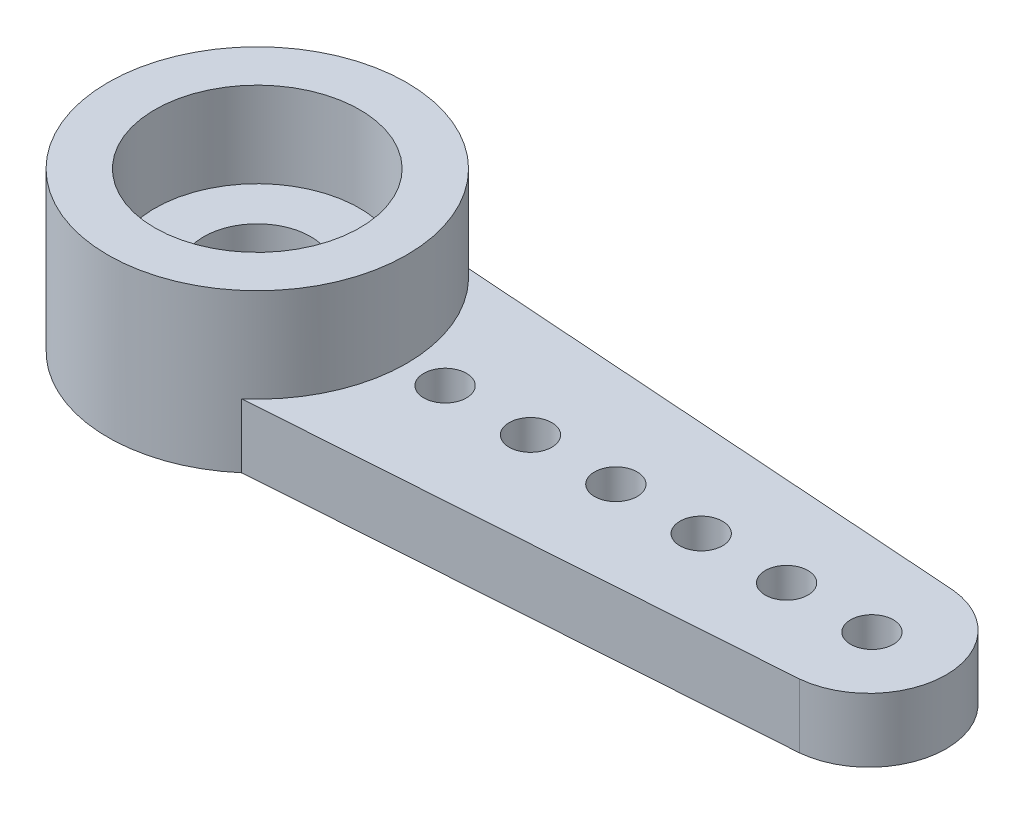
ISO-10303-21;
HEADER;
FILE_DESCRIPTION(('STEP AP214'),'2;1');
FILE_NAME('part.step','',(''),(''),'','','');
FILE_SCHEMA(('AUTOMOTIVE_DESIGN { 1 0 10303 214 1 1 1 1 }'));
ENDSEC;
DATA;
#1=APPLICATION_CONTEXT('core data for automotive mechanical design processes');
#2=APPLICATION_PROTOCOL_DEFINITION('international standard','automotive_design',2000,#1);
#3=PRODUCT_CONTEXT('',#1,'mechanical');
#4=PRODUCT('Part','Part','',(#3));
#5=PRODUCT_RELATED_PRODUCT_CATEGORY('part','',(#4));
#6=PRODUCT_DEFINITION_FORMATION('','',#4);
#7=PRODUCT_DEFINITION_CONTEXT('part definition',#1,'design');
#8=PRODUCT_DEFINITION('design','',#6,#7);
#9=PRODUCT_DEFINITION_SHAPE('','',#8);
#10=(LENGTH_UNIT() NAMED_UNIT(*) SI_UNIT(.MILLI.,.METRE.));
#11=(NAMED_UNIT(*) PLANE_ANGLE_UNIT() SI_UNIT($,.RADIAN.));
#12=(NAMED_UNIT(*) SI_UNIT($,.STERADIAN.) SOLID_ANGLE_UNIT());
#13=UNCERTAINTY_MEASURE_WITH_UNIT(LENGTH_MEASURE(1.E-05),#10,'distance_accuracy_value','');
#14=(GEOMETRIC_REPRESENTATION_CONTEXT(3) GLOBAL_UNCERTAINTY_ASSIGNED_CONTEXT((#13)) GLOBAL_UNIT_ASSIGNED_CONTEXT((#10,
#11,#12)) REPRESENTATION_CONTEXT('',''));
#15=CARTESIAN_POINT('',(0.,0.,0.));
#16=DIRECTION('',(0.,0.,1.));
#17=DIRECTION('',(1.,0.,0.));
#18=AXIS2_PLACEMENT_3D('',#15,#16,#17);
#19=CARTESIAN_POINT('',(0.,1.7,0.));
#20=DIRECTION('',(0.,1.,0.));
#21=DIRECTION('',(0.,0.,1.));
#22=AXIS2_PLACEMENT_3D('',#19,#20,#21);
#23=PLANE('',#22);
#24=CARTESIAN_POINT('',(0.,1.7,0.));
#25=DIRECTION('',(0.,1.,0.));
#26=DIRECTION('',(0.,0.,1.));
#27=AXIS2_PLACEMENT_3D('',#24,#25,#26);
#28=CIRCLE('',#27,2.4);
#29=CARTESIAN_POINT('',(0.,1.7,2.4));
#30=VERTEX_POINT('',#29);
#31=EDGE_CURVE('E141',#30,#30,#28,.T.);
#32=ORIENTED_EDGE('',*,*,#31,.T.);
#33=EDGE_LOOP('',(#32));
#34=FACE_BOUND('',#33,.T.);
#35=CARTESIAN_POINT('',(0.,1.7,0.));
#36=DIRECTION('',(0.,-1.,0.));
#37=DIRECTION('',(0.,0.,-1.));
#38=AXIS2_PLACEMENT_3D('',#35,#36,#37);
#39=CIRCLE('',#38,1.25);
#40=CARTESIAN_POINT('',(0.,1.7,-1.25));
#41=VERTEX_POINT('',#40);
#42=EDGE_CURVE('E18',#41,#41,#39,.T.);
#43=ORIENTED_EDGE('',*,*,#42,.T.);
#44=EDGE_LOOP('',(#43));
#45=FACE_BOUND('',#44,.T.);
#46=ADVANCED_FACE('F15',(#34,#45),#23,.T.);
#47=CARTESIAN_POINT('',(0.,3.7,0.));
#48=DIRECTION('',(0.,-1.,0.));
#49=DIRECTION('',(0.,0.,-1.));
#50=AXIS2_PLACEMENT_3D('',#47,#48,#49);
#51=CYLINDRICAL_SURFACE('',#50,1.25);
#52=CARTESIAN_POINT('',(0.,1.,0.));
#53=DIRECTION('',(0.,-1.,0.));
#54=DIRECTION('',(0.,0.,-1.));
#55=AXIS2_PLACEMENT_3D('',#52,#53,#54);
#56=CIRCLE('',#55,1.25);
#57=CARTESIAN_POINT('',(0.,1.,-1.25));
#58=VERTEX_POINT('',#57);
#59=EDGE_CURVE('E139',#58,#58,#56,.F.);
#60=ORIENTED_EDGE('',*,*,#59,.F.);
#61=EDGE_LOOP('',(#60));
#62=FACE_BOUND('',#61,.T.);
#63=ORIENTED_EDGE('',*,*,#42,.F.);
#64=EDGE_LOOP('',(#63));
#65=FACE_BOUND('',#64,.T.);
#66=ADVANCED_FACE('F149',(#62,#65),#51,.F.);
#67=CARTESIAN_POINT('',(0.,1.7,0.));
#68=DIRECTION('',(0.,1.,0.));
#69=DIRECTION('',(0.,0.,1.));
#70=AXIS2_PLACEMENT_3D('',#67,#68,#69);
#71=CYLINDRICAL_SURFACE('',#70,2.4);
#72=CARTESIAN_POINT('',(0.,3.7,0.));
#73=DIRECTION('',(0.,1.,0.));
#74=DIRECTION('',(0.,0.,1.));
#75=AXIS2_PLACEMENT_3D('',#72,#73,#74);
#76=CIRCLE('',#75,2.4);
#77=CARTESIAN_POINT('',(0.,3.7,2.4));
#78=VERTEX_POINT('',#77);
#79=EDGE_CURVE('E136',#78,#78,#76,.F.);
#80=ORIENTED_EDGE('',*,*,#79,.F.);
#81=EDGE_LOOP('',(#80));
#82=FACE_BOUND('',#81,.T.);
#83=ORIENTED_EDGE('',*,*,#31,.F.);
#84=EDGE_LOOP('',(#83));
#85=FACE_BOUND('',#84,.T.);
#86=ADVANCED_FACE('F151',(#82,#85),#71,.F.);
#87=CARTESIAN_POINT('',(0.,1.,0.));
#88=DIRECTION('',(0.,-1.,0.));
#89=DIRECTION('',(0.,0.,-1.));
#90=AXIS2_PLACEMENT_3D('',#87,#88,#89);
#91=PLANE('',#90);
#92=CARTESIAN_POINT('',(0.,1.,0.));
#93=DIRECTION('',(0.,-1.,0.));
#94=DIRECTION('',(0.,0.,-1.));
#95=AXIS2_PLACEMENT_3D('',#92,#93,#94);
#96=CIRCLE('',#95,2.4);
#97=CARTESIAN_POINT('',(0.,1.,-2.4));
#98=VERTEX_POINT('',#97);
#99=EDGE_CURVE('E76',#98,#98,#96,.T.);
#100=ORIENTED_EDGE('',*,*,#99,.T.);
#101=EDGE_LOOP('',(#100));
#102=FACE_BOUND('',#101,.T.);
#103=ORIENTED_EDGE('',*,*,#59,.T.);
#104=EDGE_LOOP('',(#103));
#105=FACE_BOUND('',#104,.T.);
#106=ADVANCED_FACE('F158',(#102,#105),#91,.T.);
#107=CARTESIAN_POINT('',(0.,3.7,0.));
#108=DIRECTION('',(0.,1.,0.));
#109=DIRECTION('',(0.,0.,1.));
#110=AXIS2_PLACEMENT_3D('',#107,#108,#109);
#111=PLANE('',#110);
#112=CARTESIAN_POINT('',(0.,3.7,0.));
#113=DIRECTION('',(0.,-1.,0.));
#114=DIRECTION('',(0.,0.,-1.));
#115=AXIS2_PLACEMENT_3D('',#112,#113,#114);
#116=CIRCLE('',#115,3.5);
#117=CARTESIAN_POINT('',(0.,3.7,-3.5));
#118=VERTEX_POINT('',#117);
#119=EDGE_CURVE('E87',#118,#118,#116,.T.);
#120=ORIENTED_EDGE('',*,*,#119,.F.);
#121=EDGE_LOOP('',(#120));
#122=FACE_BOUND('',#121,.T.);
#123=ORIENTED_EDGE('',*,*,#79,.T.);
#124=EDGE_LOOP('',(#123));
#125=FACE_BOUND('',#124,.T.);
#126=ADVANCED_FACE('F210',(#122,#125),#111,.T.);
#127=CARTESIAN_POINT('',(14.3294319151538,1.5,0.));
#128=DIRECTION('',(0.,1.,0.));
#129=DIRECTION('',(0.,0.,1.));
#130=AXIS2_PLACEMENT_3D('',#127,#128,#129);
#131=PLANE('',#130);
#132=CARTESIAN_POINT('',(14.3294319151538,1.5,0.));
#133=DIRECTION('',(0.,-1.,0.));
#134=DIRECTION('',(0.,0.,-1.));
#135=AXIS2_PLACEMENT_3D('',#132,#133,#134);
#136=CIRCLE('',#135,1.8083256925511);
#137=CARTESIAN_POINT('',(14.5027576499436,1.5,-1.8));
#138=VERTEX_POINT('',#137);
#139=CARTESIAN_POINT('',(14.5027576499436,1.5,1.8));
#140=VERTEX_POINT('',#139);
#141=EDGE_CURVE('E58',#138,#140,#136,.T.);
#142=ORIENTED_EDGE('',*,*,#141,.F.);
#143=DIRECTION('',(-0.99758648548161,0.,-0.0694348902530237));
#144=VECTOR('',#143,1.);
#145=CARTESIAN_POINT('',(2.286,1.5,-2.65032148993287));
#146=LINE('',#145,#144);
#147=CARTESIAN_POINT('',(2.286,1.5,-2.65032148993287));
#148=VERTEX_POINT('',#147);
#149=EDGE_CURVE('E53',#148,#138,#146,.F.);
#150=ORIENTED_EDGE('',*,*,#149,.F.);
#151=CARTESIAN_POINT('',(0.,1.5,0.));
#152=DIRECTION('',(0.,-1.,0.));
#153=DIRECTION('',(0.,0.,-1.));
#154=AXIS2_PLACEMENT_3D('',#151,#152,#153);
#155=CIRCLE('',#154,3.5);
#156=CARTESIAN_POINT('',(2.286,1.5,2.65032148993287));
#157=VERTEX_POINT('',#156);
#158=EDGE_CURVE('E72',#157,#148,#155,.F.);
#159=ORIENTED_EDGE('',*,*,#158,.F.);
#160=DIRECTION('',(0.99758648548161,0.,-0.0694348902530237));
#161=VECTOR('',#160,1.);
#162=CARTESIAN_POINT('',(2.286,1.5,2.65032148993287));
#163=LINE('',#162,#161);
#164=EDGE_CURVE('E67',#140,#157,#163,.F.);
#165=ORIENTED_EDGE('',*,*,#164,.F.);
#166=EDGE_LOOP('',(#142,#150,#159,#165));
#167=FACE_BOUND('',#166,.T.);
#168=CARTESIAN_POINT('',(14.4,1.5,0.));
#169=DIRECTION('',(0.,-1.,0.));
#170=DIRECTION('',(0.,0.,-1.));
#171=AXIS2_PLACEMENT_3D('',#168,#169,#170);
#172=CIRCLE('',#171,0.500000000000001);
#173=CARTESIAN_POINT('',(14.4,1.5,-0.500000000000001));
#174=VERTEX_POINT('',#173);
#175=EDGE_CURVE('E118',#174,#174,#172,.T.);
#176=ORIENTED_EDGE('',*,*,#175,.T.);
#177=EDGE_LOOP('',(#176));
#178=FACE_BOUND('',#177,.T.);
#179=CARTESIAN_POINT('',(12.4,1.5,0.));
#180=DIRECTION('',(0.,-1.,0.));
#181=DIRECTION('',(0.,0.,-1.));
#182=AXIS2_PLACEMENT_3D('',#179,#180,#181);
#183=CIRCLE('',#182,0.500000000000001);
#184=CARTESIAN_POINT('',(12.4,1.5,-0.500000000000001));
#185=VERTEX_POINT('',#184);
#186=EDGE_CURVE('E121',#185,#185,#183,.T.);
#187=ORIENTED_EDGE('',*,*,#186,.T.);
#188=EDGE_LOOP('',(#187));
#189=FACE_BOUND('',#188,.T.);
#190=CARTESIAN_POINT('',(10.4,1.5,0.));
#191=DIRECTION('',(0.,-1.,0.));
#192=DIRECTION('',(0.,0.,-1.));
#193=AXIS2_PLACEMENT_3D('',#190,#191,#192);
#194=CIRCLE('',#193,0.500000000000001);
#195=CARTESIAN_POINT('',(10.4,1.5,-0.500000000000001));
#196=VERTEX_POINT('',#195);
#197=EDGE_CURVE('E124',#196,#196,#194,.T.);
#198=ORIENTED_EDGE('',*,*,#197,.T.);
#199=EDGE_LOOP('',(#198));
#200=FACE_BOUND('',#199,.T.);
#201=CARTESIAN_POINT('',(8.4,1.5,0.));
#202=DIRECTION('',(0.,-1.,0.));
#203=DIRECTION('',(0.,0.,-1.));
#204=AXIS2_PLACEMENT_3D('',#201,#202,#203);
#205=CIRCLE('',#204,0.500000000000001);
#206=CARTESIAN_POINT('',(8.4,1.5,-0.500000000000001));
#207=VERTEX_POINT('',#206);
#208=EDGE_CURVE('E127',#207,#207,#205,.T.);
#209=ORIENTED_EDGE('',*,*,#208,.T.);
#210=EDGE_LOOP('',(#209));
#211=FACE_BOUND('',#210,.T.);
#212=CARTESIAN_POINT('',(6.4,1.5,0.));
#213=DIRECTION('',(0.,-1.,0.));
#214=DIRECTION('',(0.,0.,-1.));
#215=AXIS2_PLACEMENT_3D('',#212,#213,#214);
#216=CIRCLE('',#215,0.500000000000001);
#217=CARTESIAN_POINT('',(6.4,1.5,-0.500000000000001));
#218=VERTEX_POINT('',#217);
#219=EDGE_CURVE('E130',#218,#218,#216,.T.);
#220=ORIENTED_EDGE('',*,*,#219,.T.);
#221=EDGE_LOOP('',(#220));
#222=FACE_BOUND('',#221,.T.);
#223=CARTESIAN_POINT('',(4.4,1.5,0.));
#224=DIRECTION('',(0.,-1.,0.));
#225=DIRECTION('',(0.,0.,-1.));
#226=AXIS2_PLACEMENT_3D('',#223,#224,#225);
#227=CIRCLE('',#226,0.500000000000001);
#228=CARTESIAN_POINT('',(4.4,1.5,-0.500000000000001));
#229=VERTEX_POINT('',#228);
#230=EDGE_CURVE('E133',#229,#229,#227,.T.);
#231=ORIENTED_EDGE('',*,*,#230,.T.);
#232=EDGE_LOOP('',(#231));
#233=FACE_BOUND('',#232,.T.);
#234=ADVANCED_FACE('F70',(#167,#178,#189,#200,#211,#222,#233),#131,.T.);
#235=CARTESIAN_POINT('',(4.4,3.7,0.));
#236=DIRECTION('',(0.,-1.,0.));
#237=DIRECTION('',(0.,0.,-1.));
#238=AXIS2_PLACEMENT_3D('',#235,#236,#237);
#239=CYLINDRICAL_SURFACE('',#238,0.500000000000001);
#240=ORIENTED_EDGE('',*,*,#230,.F.);
#241=EDGE_LOOP('',(#240));
#242=FACE_BOUND('',#241,.T.);
#243=CARTESIAN_POINT('',(4.4,0.,0.));
#244=DIRECTION('',(0.,-1.,0.));
#245=DIRECTION('',(0.,0.,-1.));
#246=AXIS2_PLACEMENT_3D('',#243,#244,#245);
#247=CIRCLE('',#246,0.500000000000001);
#248=CARTESIAN_POINT('',(4.4,0.,-0.500000000000001));
#249=VERTEX_POINT('',#248);
#250=EDGE_CURVE('E109',#249,#249,#247,.T.);
#251=ORIENTED_EDGE('',*,*,#250,.T.);
#252=EDGE_LOOP('',(#251));
#253=FACE_BOUND('',#252,.T.);
#254=ADVANCED_FACE('F203',(#242,#253),#239,.F.);
#255=CARTESIAN_POINT('',(6.4,3.7,0.));
#256=DIRECTION('',(0.,-1.,0.));
#257=DIRECTION('',(0.,0.,-1.));
#258=AXIS2_PLACEMENT_3D('',#255,#256,#257);
#259=CYLINDRICAL_SURFACE('',#258,0.500000000000001);
#260=ORIENTED_EDGE('',*,*,#219,.F.);
#261=EDGE_LOOP('',(#260));
#262=FACE_BOUND('',#261,.T.);
#263=CARTESIAN_POINT('',(6.4,0.,0.));
#264=DIRECTION('',(0.,-1.,0.));
#265=DIRECTION('',(0.,0.,-1.));
#266=AXIS2_PLACEMENT_3D('',#263,#264,#265);
#267=CIRCLE('',#266,0.500000000000001);
#268=CARTESIAN_POINT('',(6.4,0.,-0.500000000000001));
#269=VERTEX_POINT('',#268);
#270=EDGE_CURVE('E106',#269,#269,#267,.T.);
#271=ORIENTED_EDGE('',*,*,#270,.T.);
#272=EDGE_LOOP('',(#271));
#273=FACE_BOUND('',#272,.T.);
#274=ADVANCED_FACE('F199',(#262,#273),#259,.F.);
#275=CARTESIAN_POINT('',(8.4,3.7,0.));
#276=DIRECTION('',(0.,-1.,0.));
#277=DIRECTION('',(0.,0.,-1.));
#278=AXIS2_PLACEMENT_3D('',#275,#276,#277);
#279=CYLINDRICAL_SURFACE('',#278,0.500000000000001);
#280=ORIENTED_EDGE('',*,*,#208,.F.);
#281=EDGE_LOOP('',(#280));
#282=FACE_BOUND('',#281,.T.);
#283=CARTESIAN_POINT('',(8.4,0.,0.));
#284=DIRECTION('',(0.,-1.,0.));
#285=DIRECTION('',(0.,0.,-1.));
#286=AXIS2_PLACEMENT_3D('',#283,#284,#285);
#287=CIRCLE('',#286,0.500000000000001);
#288=CARTESIAN_POINT('',(8.4,0.,-0.500000000000001));
#289=VERTEX_POINT('',#288);
#290=EDGE_CURVE('E103',#289,#289,#287,.T.);
#291=ORIENTED_EDGE('',*,*,#290,.T.);
#292=EDGE_LOOP('',(#291));
#293=FACE_BOUND('',#292,.T.);
#294=ADVANCED_FACE('F195',(#282,#293),#279,.F.);
#295=CARTESIAN_POINT('',(10.4,3.7,0.));
#296=DIRECTION('',(0.,-1.,0.));
#297=DIRECTION('',(0.,0.,-1.));
#298=AXIS2_PLACEMENT_3D('',#295,#296,#297);
#299=CYLINDRICAL_SURFACE('',#298,0.500000000000001);
#300=ORIENTED_EDGE('',*,*,#197,.F.);
#301=EDGE_LOOP('',(#300));
#302=FACE_BOUND('',#301,.T.);
#303=CARTESIAN_POINT('',(10.4,0.,0.));
#304=DIRECTION('',(0.,-1.,0.));
#305=DIRECTION('',(0.,0.,-1.));
#306=AXIS2_PLACEMENT_3D('',#303,#304,#305);
#307=CIRCLE('',#306,0.500000000000001);
#308=CARTESIAN_POINT('',(10.4,0.,-0.500000000000001));
#309=VERTEX_POINT('',#308);
#310=EDGE_CURVE('E100',#309,#309,#307,.T.);
#311=ORIENTED_EDGE('',*,*,#310,.T.);
#312=EDGE_LOOP('',(#311));
#313=FACE_BOUND('',#312,.T.);
#314=ADVANCED_FACE('F191',(#302,#313),#299,.F.);
#315=CARTESIAN_POINT('',(12.4,3.7,0.));
#316=DIRECTION('',(0.,-1.,0.));
#317=DIRECTION('',(0.,0.,-1.));
#318=AXIS2_PLACEMENT_3D('',#315,#316,#317);
#319=CYLINDRICAL_SURFACE('',#318,0.500000000000001);
#320=ORIENTED_EDGE('',*,*,#186,.F.);
#321=EDGE_LOOP('',(#320));
#322=FACE_BOUND('',#321,.T.);
#323=CARTESIAN_POINT('',(12.4,0.,0.));
#324=DIRECTION('',(0.,-1.,0.));
#325=DIRECTION('',(0.,0.,-1.));
#326=AXIS2_PLACEMENT_3D('',#323,#324,#325);
#327=CIRCLE('',#326,0.500000000000001);
#328=CARTESIAN_POINT('',(12.4,0.,-0.500000000000001));
#329=VERTEX_POINT('',#328);
#330=EDGE_CURVE('E97',#329,#329,#327,.T.);
#331=ORIENTED_EDGE('',*,*,#330,.T.);
#332=EDGE_LOOP('',(#331));
#333=FACE_BOUND('',#332,.T.);
#334=ADVANCED_FACE('F187',(#322,#333),#319,.F.);
#335=CARTESIAN_POINT('',(14.4,3.7,0.));
#336=DIRECTION('',(0.,-1.,0.));
#337=DIRECTION('',(0.,0.,-1.));
#338=AXIS2_PLACEMENT_3D('',#335,#336,#337);
#339=CYLINDRICAL_SURFACE('',#338,0.500000000000001);
#340=ORIENTED_EDGE('',*,*,#175,.F.);
#341=EDGE_LOOP('',(#340));
#342=FACE_BOUND('',#341,.T.);
#343=CARTESIAN_POINT('',(14.4,0.,0.));
#344=DIRECTION('',(0.,-1.,0.));
#345=DIRECTION('',(0.,0.,-1.));
#346=AXIS2_PLACEMENT_3D('',#343,#344,#345);
#347=CIRCLE('',#346,0.500000000000001);
#348=CARTESIAN_POINT('',(14.4,0.,-0.500000000000001));
#349=VERTEX_POINT('',#348);
#350=EDGE_CURVE('E94',#349,#349,#347,.T.);
#351=ORIENTED_EDGE('',*,*,#350,.T.);
#352=EDGE_LOOP('',(#351));
#353=FACE_BOUND('',#352,.T.);
#354=ADVANCED_FACE('F183',(#342,#353),#339,.F.);
#355=CARTESIAN_POINT('',(0.,1.,0.));
#356=DIRECTION('',(0.,-1.,0.));
#357=DIRECTION('',(0.,0.,-1.));
#358=AXIS2_PLACEMENT_3D('',#355,#356,#357);
#359=CYLINDRICAL_SURFACE('',#358,2.4);
#360=ORIENTED_EDGE('',*,*,#99,.F.);
#361=EDGE_LOOP('',(#360));
#362=FACE_BOUND('',#361,.T.);
#363=CARTESIAN_POINT('',(0.,0.,0.));
#364=DIRECTION('',(0.,-1.,0.));
#365=DIRECTION('',(0.,0.,-1.));
#366=AXIS2_PLACEMENT_3D('',#363,#364,#365);
#367=CIRCLE('',#366,2.4);
#368=CARTESIAN_POINT('',(0.,0.,-2.4));
#369=VERTEX_POINT('',#368);
#370=EDGE_CURVE('E91',#369,#369,#367,.T.);
#371=ORIENTED_EDGE('',*,*,#370,.T.);
#372=EDGE_LOOP('',(#371));
#373=FACE_BOUND('',#372,.T.);
#374=ADVANCED_FACE('F180',(#362,#373),#359,.F.);
#375=CARTESIAN_POINT('',(2.286,1.5,2.65032148993287));
#376=DIRECTION('',(0.0694348902530237,0.,0.99758648548161));
#377=DIRECTION('',(0.99758648548161,0.,-0.0694348902530237));
#378=AXIS2_PLACEMENT_3D('',#375,#376,#377);
#379=PLANE('',#378);
#380=ORIENTED_EDGE('',*,*,#164,.T.);
#381=DIRECTION('',(0.,-1.,0.));
#382=VECTOR('',#381,1.);
#383=CARTESIAN_POINT('',(2.286,3.7,2.65032148993287));
#384=LINE('',#383,#382);
#385=CARTESIAN_POINT('',(2.286,0.,2.65032148993287));
#386=VERTEX_POINT('',#385);
#387=EDGE_CURVE('E86',#386,#157,#384,.F.);
#388=ORIENTED_EDGE('',*,*,#387,.F.);
#389=DIRECTION('',(0.99758648548161,0.,-0.0694348902530237));
#390=VECTOR('',#389,1.);
#391=CARTESIAN_POINT('',(2.286,0.,2.65032148993287));
#392=LINE('',#391,#390);
#393=CARTESIAN_POINT('',(14.5027576499436,0.,1.8));
#394=VERTEX_POINT('',#393);
#395=EDGE_CURVE('E80',#386,#394,#392,.T.);
#396=ORIENTED_EDGE('',*,*,#395,.T.);
#397=DIRECTION('',(0.,-1.,0.));
#398=VECTOR('',#397,1.);
#399=CARTESIAN_POINT('',(14.5027576499436,1.5,1.8));
#400=LINE('',#399,#398);
#401=EDGE_CURVE('E63',#140,#394,#400,.T.);
#402=ORIENTED_EDGE('',*,*,#401,.F.);
#403=EDGE_LOOP('',(#380,#388,#396,#402));
#404=FACE_BOUND('',#403,.T.);
#405=ADVANCED_FACE('F79',(#404),#379,.T.);
#406=CARTESIAN_POINT('',(14.3294319151538,1.5,0.));
#407=DIRECTION('',(0.,-1.,0.));
#408=DIRECTION('',(0.,0.,-1.));
#409=AXIS2_PLACEMENT_3D('',#406,#407,#408);
#410=CYLINDRICAL_SURFACE('',#409,1.8083256925511);
#411=ORIENTED_EDGE('',*,*,#141,.T.);
#412=ORIENTED_EDGE('',*,*,#401,.T.);
#413=CARTESIAN_POINT('',(14.3294319151538,0.,0.));
#414=DIRECTION('',(0.,-1.,0.));
#415=DIRECTION('',(0.,0.,-1.));
#416=AXIS2_PLACEMENT_3D('',#413,#414,#415);
#417=CIRCLE('',#416,1.8083256925511);
#418=CARTESIAN_POINT('',(14.5027576499436,0.,-1.8));
#419=VERTEX_POINT('',#418);
#420=EDGE_CURVE('E24',#394,#419,#417,.F.);
#421=ORIENTED_EDGE('',*,*,#420,.T.);
#422=DIRECTION('',(0.,1.,0.));
#423=VECTOR('',#422,1.);
#424=CARTESIAN_POINT('',(14.5027576499436,1.5,-1.8));
#425=LINE('',#424,#423);
#426=EDGE_CURVE('E65',#138,#419,#425,.F.);
#427=ORIENTED_EDGE('',*,*,#426,.F.);
#428=EDGE_LOOP('',(#411,#412,#421,#427));
#429=FACE_BOUND('',#428,.T.);
#430=ADVANCED_FACE('F60',(#429),#410,.T.);
#431=CARTESIAN_POINT('',(2.286,1.5,-2.65032148993287));
#432=DIRECTION('',(0.0694348902530237,0.,-0.99758648548161));
#433=DIRECTION('',(-0.99758648548161,0.,-0.0694348902530237));
#434=AXIS2_PLACEMENT_3D('',#431,#432,#433);
#435=PLANE('',#434);
#436=ORIENTED_EDGE('',*,*,#426,.T.);
#437=DIRECTION('',(-0.99758648548161,0.,-0.0694348902530237));
#438=VECTOR('',#437,1.);
#439=CARTESIAN_POINT('',(14.5027576499436,0.,-1.8));
#440=LINE('',#439,#438);
#441=CARTESIAN_POINT('',(2.286,0.,-2.65032148993287));
#442=VERTEX_POINT('',#441);
#443=EDGE_CURVE('E10',#419,#442,#440,.T.);
#444=ORIENTED_EDGE('',*,*,#443,.T.);
#445=DIRECTION('',(0.,-1.,0.));
#446=VECTOR('',#445,1.);
#447=CARTESIAN_POINT('',(2.286,3.7,-2.65032148993287));
#448=LINE('',#447,#446);
#449=EDGE_CURVE('E112',#148,#442,#448,.T.);
#450=ORIENTED_EDGE('',*,*,#449,.F.);
#451=ORIENTED_EDGE('',*,*,#149,.T.);
#452=EDGE_LOOP('',(#436,#444,#450,#451));
#453=FACE_BOUND('',#452,.T.);
#454=ADVANCED_FACE('F169',(#453),#435,.T.);
#455=CARTESIAN_POINT('',(0.,3.7,0.));
#456=DIRECTION('',(0.,-1.,0.));
#457=DIRECTION('',(0.,0.,-1.));
#458=AXIS2_PLACEMENT_3D('',#455,#456,#457);
#459=CYLINDRICAL_SURFACE('',#458,3.5);
#460=CARTESIAN_POINT('',(0.,0.,0.));
#461=DIRECTION('',(0.,-1.,0.));
#462=DIRECTION('',(0.,0.,-1.));
#463=AXIS2_PLACEMENT_3D('',#460,#461,#462);
#464=CIRCLE('',#463,3.5);
#465=EDGE_CURVE('E33',#442,#386,#464,.F.);
#466=ORIENTED_EDGE('',*,*,#465,.T.);
#467=ORIENTED_EDGE('',*,*,#387,.T.);
#468=ORIENTED_EDGE('',*,*,#158,.T.);
#469=ORIENTED_EDGE('',*,*,#449,.T.);
#470=EDGE_LOOP('',(#466,#467,#468,#469));
#471=FACE_BOUND('',#470,.T.);
#472=ORIENTED_EDGE('',*,*,#119,.T.);
#473=EDGE_LOOP('',(#472));
#474=FACE_BOUND('',#473,.T.);
#475=ADVANCED_FACE('F164',(#471,#474),#459,.T.);
#476=CARTESIAN_POINT('',(0.,0.,0.));
#477=DIRECTION('',(0.,1.,0.));
#478=DIRECTION('',(0.,0.,1.));
#479=AXIS2_PLACEMENT_3D('',#476,#477,#478);
#480=PLANE('',#479);
#481=ORIENTED_EDGE('',*,*,#443,.F.);
#482=ORIENTED_EDGE('',*,*,#420,.F.);
#483=ORIENTED_EDGE('',*,*,#395,.F.);
#484=ORIENTED_EDGE('',*,*,#465,.F.);
#485=EDGE_LOOP('',(#481,#482,#483,#484));
#486=FACE_BOUND('',#485,.T.);
#487=ORIENTED_EDGE('',*,*,#370,.F.);
#488=EDGE_LOOP('',(#487));
#489=FACE_BOUND('',#488,.T.);
#490=ORIENTED_EDGE('',*,*,#350,.F.);
#491=EDGE_LOOP('',(#490));
#492=FACE_BOUND('',#491,.T.);
#493=ORIENTED_EDGE('',*,*,#330,.F.);
#494=EDGE_LOOP('',(#493));
#495=FACE_BOUND('',#494,.T.);
#496=ORIENTED_EDGE('',*,*,#310,.F.);
#497=EDGE_LOOP('',(#496));
#498=FACE_BOUND('',#497,.T.);
#499=ORIENTED_EDGE('',*,*,#290,.F.);
#500=EDGE_LOOP('',(#499));
#501=FACE_BOUND('',#500,.T.);
#502=ORIENTED_EDGE('',*,*,#270,.F.);
#503=EDGE_LOOP('',(#502));
#504=FACE_BOUND('',#503,.T.);
#505=ORIENTED_EDGE('',*,*,#250,.F.);
#506=EDGE_LOOP('',(#505));
#507=FACE_BOUND('',#506,.T.);
#508=ADVANCED_FACE('F162',(#486,#489,#492,#495,#498,#501,#504,#507),#480,.F.);
#509=CLOSED_SHELL('',(#46,#66,#86,#106,#126,#234,#254,#274,#294,#314,#334,#354,#374,#405,#430,
#454,#475,#508));
#510=MANIFOLD_SOLID_BREP('B1',#509);
#511=ADVANCED_BREP_SHAPE_REPRESENTATION('',(#18,#510),#14);
#512=SHAPE_DEFINITION_REPRESENTATION(#9,#511);
ENDSEC;
END-ISO-10303-21;
